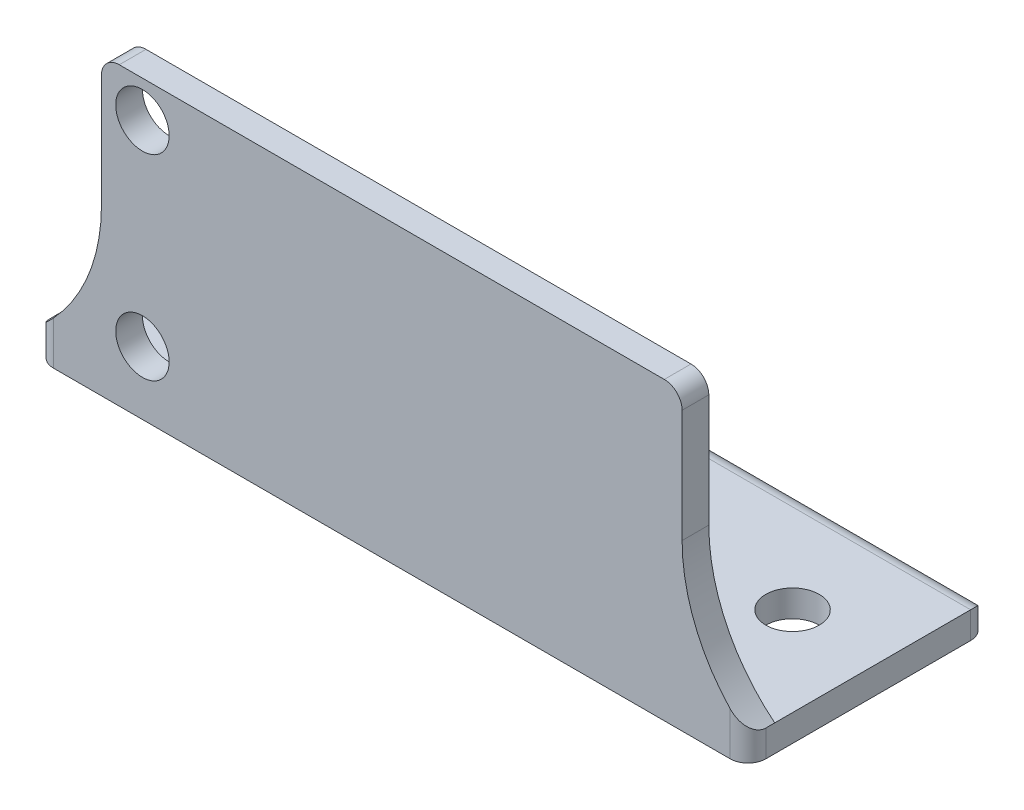
ISO-10303-21;
HEADER;
FILE_DESCRIPTION(('STEP AP214'),'2;1');
FILE_NAME('part.step','',(''),(''),'','','');
FILE_SCHEMA(('AUTOMOTIVE_DESIGN { 1 0 10303 214 1 1 1 1 }'));
ENDSEC;
DATA;
#1=APPLICATION_CONTEXT('core data for automotive mechanical design processes');
#2=APPLICATION_PROTOCOL_DEFINITION('international standard','automotive_design',2000,#1);
#3=PRODUCT_CONTEXT('',#1,'mechanical');
#4=PRODUCT('Part','Part','',(#3));
#5=PRODUCT_RELATED_PRODUCT_CATEGORY('part','',(#4));
#6=PRODUCT_DEFINITION_FORMATION('','',#4);
#7=PRODUCT_DEFINITION_CONTEXT('part definition',#1,'design');
#8=PRODUCT_DEFINITION('design','',#6,#7);
#9=PRODUCT_DEFINITION_SHAPE('','',#8);
#10=(LENGTH_UNIT() NAMED_UNIT(*) SI_UNIT(.MILLI.,.METRE.));
#11=(NAMED_UNIT(*) PLANE_ANGLE_UNIT() SI_UNIT($,.RADIAN.));
#12=(NAMED_UNIT(*) SI_UNIT($,.STERADIAN.) SOLID_ANGLE_UNIT());
#13=UNCERTAINTY_MEASURE_WITH_UNIT(LENGTH_MEASURE(1.E-05),#10,'distance_accuracy_value','');
#14=(GEOMETRIC_REPRESENTATION_CONTEXT(3) GLOBAL_UNCERTAINTY_ASSIGNED_CONTEXT((#13)) GLOBAL_UNIT_ASSIGNED_CONTEXT((#10,
#11,#12)) REPRESENTATION_CONTEXT('',''));
#15=CARTESIAN_POINT('',(0.,0.,0.));
#16=DIRECTION('',(0.,0.,1.));
#17=DIRECTION('',(1.,0.,0.));
#18=AXIS2_PLACEMENT_3D('',#15,#16,#17);
#19=CARTESIAN_POINT('',(0.,0.,1.5));
#20=DIRECTION('',(0.,0.,1.));
#21=DIRECTION('',(1.,0.,0.));
#22=AXIS2_PLACEMENT_3D('',#19,#20,#21);
#23=PLANE('',#22);
#24=CARTESIAN_POINT('',(-14.,5.5,1.5));
#25=DIRECTION('',(0.,0.,1.));
#26=DIRECTION('',(1.,0.,0.));
#27=AXIS2_PLACEMENT_3D('',#24,#25,#26);
#28=CIRCLE('',#27,1.5);
#29=CARTESIAN_POINT('',(-12.5,5.5,1.5));
#30=VERTEX_POINT('',#29);
#31=EDGE_CURVE('E379',#30,#30,#28,.T.);
#32=ORIENTED_EDGE('',*,*,#31,.F.);
#33=EDGE_LOOP('',(#32));
#34=FACE_BOUND('',#33,.T.);
#35=CARTESIAN_POINT('',(-26.3,0.215951326141568,1.5));
#36=DIRECTION('',(0.,0.,1.));
#37=DIRECTION('',(1.,0.,0.));
#38=AXIS2_PLACEMENT_3D('',#35,#36,#37);
#39=CIRCLE('',#38,10.);
#40=CARTESIAN_POINT('',(-16.3,0.215951326141575,1.5));
#41=VERTEX_POINT('',#40);
#42=CARTESIAN_POINT('',(-19.,-6.61852012379514,1.5));
#43=VERTEX_POINT('',#42);
#44=EDGE_CURVE('E204',#41,#43,#39,.F.);
#45=ORIENTED_EDGE('',*,*,#44,.T.);
#46=DIRECTION('',(0.,1.,0.));
#47=VECTOR('',#46,1.);
#48=CARTESIAN_POINT('',(-19.,-9.05,1.5));
#49=LINE('',#48,#47);
#50=CARTESIAN_POINT('',(-19.,-9.05,1.5));
#51=VERTEX_POINT('',#50);
#52=EDGE_CURVE('E397',#43,#51,#49,.F.);
#53=ORIENTED_EDGE('',*,*,#52,.T.);
#54=DIRECTION('',(-1.,0.,0.));
#55=VECTOR('',#54,1.);
#56=CARTESIAN_POINT('',(-20.,-9.05,1.5));
#57=LINE('',#56,#55);
#58=CARTESIAN_POINT('',(19.,-9.05,1.5));
#59=VERTEX_POINT('',#58);
#60=EDGE_CURVE('E361',#59,#51,#57,.T.);
#61=ORIENTED_EDGE('',*,*,#60,.F.);
#62=DIRECTION('',(0.,1.,0.));
#63=VECTOR('',#62,1.);
#64=CARTESIAN_POINT('',(19.,-7.55,1.5));
#65=LINE('',#64,#63);
#66=CARTESIAN_POINT('',(19.,-6.61852012379514,1.5));
#67=VERTEX_POINT('',#66);
#68=EDGE_CURVE('E403',#59,#67,#65,.T.);
#69=ORIENTED_EDGE('',*,*,#68,.T.);
#70=CARTESIAN_POINT('',(26.3,0.215951326141562,1.5));
#71=DIRECTION('',(0.,0.,1.));
#72=DIRECTION('',(1.,0.,0.));
#73=AXIS2_PLACEMENT_3D('',#70,#71,#72);
#74=CIRCLE('',#73,10.);
#75=CARTESIAN_POINT('',(16.3,0.215951326141562,1.5));
#76=VERTEX_POINT('',#75);
#77=EDGE_CURVE('E163',#67,#76,#74,.F.);
#78=ORIENTED_EDGE('',*,*,#77,.T.);
#79=DIRECTION('',(0.,1.,0.));
#80=VECTOR('',#79,1.);
#81=CARTESIAN_POINT('',(16.3,7.55,1.5));
#82=LINE('',#81,#80);
#83=CARTESIAN_POINT('',(16.3,6.55,1.5));
#84=VERTEX_POINT('',#83);
#85=EDGE_CURVE('E173',#76,#84,#82,.T.);
#86=ORIENTED_EDGE('',*,*,#85,.T.);
#87=CARTESIAN_POINT('',(15.3,6.55,1.5));
#88=DIRECTION('',(0.,0.,1.));
#89=DIRECTION('',(1.,0.,0.));
#90=AXIS2_PLACEMENT_3D('',#87,#88,#89);
#91=CIRCLE('',#90,1.);
#92=CARTESIAN_POINT('',(15.3,7.55,1.5));
#93=VERTEX_POINT('',#92);
#94=EDGE_CURVE('E410',#84,#93,#91,.T.);
#95=ORIENTED_EDGE('',*,*,#94,.T.);
#96=DIRECTION('',(-1.,0.,0.));
#97=VECTOR('',#96,1.);
#98=CARTESIAN_POINT('',(-16.3,7.55,1.5));
#99=LINE('',#98,#97);
#100=CARTESIAN_POINT('',(-15.3,7.55,1.5));
#101=VERTEX_POINT('',#100);
#102=EDGE_CURVE('E175',#93,#101,#99,.T.);
#103=ORIENTED_EDGE('',*,*,#102,.T.);
#104=CARTESIAN_POINT('',(-15.3,6.55,1.5));
#105=DIRECTION('',(0.,0.,1.));
#106=DIRECTION('',(1.,0.,0.));
#107=AXIS2_PLACEMENT_3D('',#104,#105,#106);
#108=CIRCLE('',#107,1.);
#109=CARTESIAN_POINT('',(-16.3,6.55,1.5));
#110=VERTEX_POINT('',#109);
#111=EDGE_CURVE('E224',#101,#110,#108,.T.);
#112=ORIENTED_EDGE('',*,*,#111,.T.);
#113=DIRECTION('',(0.,-1.,0.));
#114=VECTOR('',#113,1.);
#115=CARTESIAN_POINT('',(-16.3,7.55,1.5));
#116=LINE('',#115,#114);
#117=EDGE_CURVE('E188',#110,#41,#116,.T.);
#118=ORIENTED_EDGE('',*,*,#117,.T.);
#119=EDGE_LOOP('',(#45,#53,#61,#69,#78,#86,#95,#103,#112,#118));
#120=FACE_BOUND('',#119,.T.);
#121=CARTESIAN_POINT('',(-14.,-5.5,1.5));
#122=DIRECTION('',(0.,0.,1.));
#123=DIRECTION('',(1.,0.,0.));
#124=AXIS2_PLACEMENT_3D('',#121,#122,#123);
#125=CIRCLE('',#124,1.5);
#126=CARTESIAN_POINT('',(-12.5,-5.5,1.5));
#127=VERTEX_POINT('',#126);
#128=EDGE_CURVE('E371',#127,#127,#125,.T.);
#129=ORIENTED_EDGE('',*,*,#128,.F.);
#130=EDGE_LOOP('',(#129));
#131=FACE_BOUND('',#130,.T.);
#132=ADVANCED_FACE('F39',(#34,#120,#131),#23,.T.);
#133=CARTESIAN_POINT('',(0.,0.,0.));
#134=DIRECTION('',(0.,0.,1.));
#135=DIRECTION('',(1.,0.,0.));
#136=AXIS2_PLACEMENT_3D('',#133,#134,#135);
#137=PLANE('',#136);
#138=DIRECTION('',(-1.,0.,0.));
#139=VECTOR('',#138,1.);
#140=CARTESIAN_POINT('',(-16.3,7.55,0.));
#141=LINE('',#140,#139);
#142=CARTESIAN_POINT('',(15.3,7.55,0.));
#143=VERTEX_POINT('',#142);
#144=CARTESIAN_POINT('',(-15.3,7.55,0.));
#145=VERTEX_POINT('',#144);
#146=EDGE_CURVE('E182',#143,#145,#141,.T.);
#147=ORIENTED_EDGE('',*,*,#146,.F.);
#148=CARTESIAN_POINT('',(15.3,6.55,0.));
#149=DIRECTION('',(0.,0.,1.));
#150=DIRECTION('',(1.,0.,0.));
#151=AXIS2_PLACEMENT_3D('',#148,#149,#150);
#152=CIRCLE('',#151,1.);
#153=CARTESIAN_POINT('',(16.3,6.55,0.));
#154=VERTEX_POINT('',#153);
#155=EDGE_CURVE('E180',#143,#154,#152,.F.);
#156=ORIENTED_EDGE('',*,*,#155,.T.);
#157=DIRECTION('',(0.,1.,0.));
#158=VECTOR('',#157,1.);
#159=CARTESIAN_POINT('',(16.3,7.55,0.));
#160=LINE('',#159,#158);
#161=CARTESIAN_POINT('',(16.3,0.215951326141562,0.));
#162=VERTEX_POINT('',#161);
#163=EDGE_CURVE('E170',#162,#154,#160,.T.);
#164=ORIENTED_EDGE('',*,*,#163,.F.);
#165=CARTESIAN_POINT('',(26.3,0.215951326141562,0.));
#166=DIRECTION('',(0.,0.,1.));
#167=DIRECTION('',(1.,0.,0.));
#168=AXIS2_PLACEMENT_3D('',#165,#166,#167);
#169=CIRCLE('',#168,10.);
#170=CARTESIAN_POINT('',(20.,-7.55,0.));
#171=VERTEX_POINT('',#170);
#172=EDGE_CURVE('E152',#162,#171,#169,.T.);
#173=ORIENTED_EDGE('',*,*,#172,.T.);
#174=DIRECTION('',(1.,0.,0.));
#175=VECTOR('',#174,1.);
#176=CARTESIAN_POINT('',(-16.3,-7.55,0.));
#177=LINE('',#176,#175);
#178=CARTESIAN_POINT('',(-20.,-7.55,0.));
#179=VERTEX_POINT('',#178);
#180=EDGE_CURVE('E183',#179,#171,#177,.T.);
#181=ORIENTED_EDGE('',*,*,#180,.F.);
#182=CARTESIAN_POINT('',(-26.3,0.215951326141568,0.));
#183=DIRECTION('',(0.,0.,1.));
#184=DIRECTION('',(1.,0.,0.));
#185=AXIS2_PLACEMENT_3D('',#182,#183,#184);
#186=CIRCLE('',#185,10.);
#187=CARTESIAN_POINT('',(-16.3,0.215951326141575,0.));
#188=VERTEX_POINT('',#187);
#189=EDGE_CURVE('E200',#179,#188,#186,.T.);
#190=ORIENTED_EDGE('',*,*,#189,.T.);
#191=DIRECTION('',(0.,-1.,0.));
#192=VECTOR('',#191,1.);
#193=CARTESIAN_POINT('',(-16.3,7.55,0.));
#194=LINE('',#193,#192);
#195=CARTESIAN_POINT('',(-16.3,6.55,0.));
#196=VERTEX_POINT('',#195);
#197=EDGE_CURVE('E191',#196,#188,#194,.T.);
#198=ORIENTED_EDGE('',*,*,#197,.F.);
#199=CARTESIAN_POINT('',(-15.3,6.55,0.));
#200=DIRECTION('',(0.,0.,1.));
#201=DIRECTION('',(1.,0.,0.));
#202=AXIS2_PLACEMENT_3D('',#199,#200,#201);
#203=CIRCLE('',#202,1.);
#204=EDGE_CURVE('E310',#196,#145,#203,.F.);
#205=ORIENTED_EDGE('',*,*,#204,.T.);
#206=EDGE_LOOP('',(#147,#156,#164,#173,#181,#190,#198,#205));
#207=FACE_BOUND('',#206,.T.);
#208=CARTESIAN_POINT('',(-14.,5.5,0.));
#209=DIRECTION('',(0.,0.,1.));
#210=DIRECTION('',(1.,0.,0.));
#211=AXIS2_PLACEMENT_3D('',#208,#209,#210);
#212=CIRCLE('',#211,1.5);
#213=CARTESIAN_POINT('',(-12.5,5.5,0.));
#214=VERTEX_POINT('',#213);
#215=EDGE_CURVE('E375',#214,#214,#212,.T.);
#216=ORIENTED_EDGE('',*,*,#215,.T.);
#217=EDGE_LOOP('',(#216));
#218=FACE_BOUND('',#217,.T.);
#219=CARTESIAN_POINT('',(-14.,-5.5,0.));
#220=DIRECTION('',(0.,0.,1.));
#221=DIRECTION('',(1.,0.,0.));
#222=AXIS2_PLACEMENT_3D('',#219,#220,#221);
#223=CIRCLE('',#222,1.5);
#224=CARTESIAN_POINT('',(-12.5,-5.5,0.));
#225=VERTEX_POINT('',#224);
#226=EDGE_CURVE('E365',#225,#225,#223,.T.);
#227=ORIENTED_EDGE('',*,*,#226,.T.);
#228=EDGE_LOOP('',(#227));
#229=FACE_BOUND('',#228,.T.);
#230=ADVANCED_FACE('F178',(#207,#218,#229),#137,.F.);
#231=CARTESIAN_POINT('',(-16.3,7.55,1.5));
#232=DIRECTION('',(1.,0.,0.));
#233=DIRECTION('',(0.,1.,0.));
#234=AXIS2_PLACEMENT_3D('',#231,#232,#233);
#235=PLANE('',#234);
#236=ORIENTED_EDGE('',*,*,#117,.F.);
#237=DIRECTION('',(0.,0.,-1.));
#238=VECTOR('',#237,1.);
#239=CARTESIAN_POINT('',(-16.3,6.55,1.5));
#240=LINE('',#239,#238);
#241=EDGE_CURVE('E302',#110,#196,#240,.T.);
#242=ORIENTED_EDGE('',*,*,#241,.T.);
#243=ORIENTED_EDGE('',*,*,#197,.T.);
#244=DIRECTION('',(0.,0.,1.));
#245=VECTOR('',#244,1.);
#246=CARTESIAN_POINT('',(-16.3,0.215951326141575,1.5));
#247=LINE('',#246,#245);
#248=EDGE_CURVE('E164',#188,#41,#247,.T.);
#249=ORIENTED_EDGE('',*,*,#248,.T.);
#250=EDGE_LOOP('',(#236,#242,#243,#249));
#251=FACE_BOUND('',#250,.T.);
#252=ADVANCED_FACE('F238',(#251),#235,.F.);
#253=CARTESIAN_POINT('',(16.3,7.55,1.5));
#254=DIRECTION('',(-1.,0.,0.));
#255=DIRECTION('',(0.,0.,1.));
#256=AXIS2_PLACEMENT_3D('',#253,#254,#255);
#257=PLANE('',#256);
#258=ORIENTED_EDGE('',*,*,#163,.T.);
#259=DIRECTION('',(0.,0.,-1.));
#260=VECTOR('',#259,1.);
#261=CARTESIAN_POINT('',(16.3,6.55,1.5));
#262=LINE('',#261,#260);
#263=EDGE_CURVE('E313',#154,#84,#262,.F.);
#264=ORIENTED_EDGE('',*,*,#263,.T.);
#265=ORIENTED_EDGE('',*,*,#85,.F.);
#266=DIRECTION('',(0.,0.,-1.));
#267=VECTOR('',#266,1.);
#268=CARTESIAN_POINT('',(16.3,0.215951326141562,1.5));
#269=LINE('',#268,#267);
#270=EDGE_CURVE('E156',#76,#162,#269,.T.);
#271=ORIENTED_EDGE('',*,*,#270,.T.);
#272=EDGE_LOOP('',(#258,#264,#265,#271));
#273=FACE_BOUND('',#272,.T.);
#274=ADVANCED_FACE('F169',(#273),#257,.F.);
#275=CARTESIAN_POINT('',(-16.3,7.55,1.5));
#276=DIRECTION('',(0.,-1.,0.));
#277=DIRECTION('',(0.,0.,-1.));
#278=AXIS2_PLACEMENT_3D('',#275,#276,#277);
#279=PLANE('',#278);
#280=ORIENTED_EDGE('',*,*,#102,.F.);
#281=DIRECTION('',(0.,0.,-1.));
#282=VECTOR('',#281,1.);
#283=CARTESIAN_POINT('',(15.3,7.55,1.5));
#284=LINE('',#283,#282);
#285=EDGE_CURVE('E439',#93,#143,#284,.T.);
#286=ORIENTED_EDGE('',*,*,#285,.T.);
#287=ORIENTED_EDGE('',*,*,#146,.T.);
#288=DIRECTION('',(0.,0.,-1.));
#289=VECTOR('',#288,1.);
#290=CARTESIAN_POINT('',(-15.3,7.55,1.5));
#291=LINE('',#290,#289);
#292=EDGE_CURVE('E436',#145,#101,#291,.F.);
#293=ORIENTED_EDGE('',*,*,#292,.T.);
#294=EDGE_LOOP('',(#280,#286,#287,#293));
#295=FACE_BOUND('',#294,.T.);
#296=ADVANCED_FACE('F289',(#295),#279,.F.);
#297=CARTESIAN_POINT('',(-14.,5.5,1.5));
#298=DIRECTION('',(0.,0.,-1.));
#299=DIRECTION('',(-1.,0.,0.));
#300=AXIS2_PLACEMENT_3D('',#297,#298,#299);
#301=CYLINDRICAL_SURFACE('',#300,1.5);
#302=ORIENTED_EDGE('',*,*,#31,.T.);
#303=EDGE_LOOP('',(#302));
#304=FACE_BOUND('',#303,.T.);
#305=ORIENTED_EDGE('',*,*,#215,.F.);
#306=EDGE_LOOP('',(#305));
#307=FACE_BOUND('',#306,.T.);
#308=ADVANCED_FACE('F286',(#304,#307),#301,.F.);
#309=CARTESIAN_POINT('',(-14.,-5.5,1.5));
#310=DIRECTION('',(0.,0.,-1.));
#311=DIRECTION('',(-1.,0.,0.));
#312=AXIS2_PLACEMENT_3D('',#309,#310,#311);
#313=CYLINDRICAL_SURFACE('',#312,1.5);
#314=ORIENTED_EDGE('',*,*,#128,.T.);
#315=EDGE_LOOP('',(#314));
#316=FACE_BOUND('',#315,.T.);
#317=ORIENTED_EDGE('',*,*,#226,.F.);
#318=EDGE_LOOP('',(#317));
#319=FACE_BOUND('',#318,.T.);
#320=ADVANCED_FACE('F475',(#316,#319),#313,.F.);
#321=CARTESIAN_POINT('',(0.,-9.05,0.));
#322=DIRECTION('',(0.,-1.,0.));
#323=DIRECTION('',(0.,0.,-1.));
#324=AXIS2_PLACEMENT_3D('',#321,#322,#323);
#325=PLANE('',#324);
#326=CARTESIAN_POINT('',(-15.,-9.05,-6.));
#327=DIRECTION('',(0.,-1.,0.));
#328=DIRECTION('',(0.,0.,-1.));
#329=AXIS2_PLACEMENT_3D('',#326,#327,#328);
#330=CIRCLE('',#329,1.5);
#331=CARTESIAN_POINT('',(-15.,-9.05,-7.5));
#332=VERTEX_POINT('',#331);
#333=EDGE_CURVE('E340',#332,#332,#330,.T.);
#334=ORIENTED_EDGE('',*,*,#333,.F.);
#335=EDGE_LOOP('',(#334));
#336=FACE_BOUND('',#335,.T.);
#337=ORIENTED_EDGE('',*,*,#60,.T.);
#338=CARTESIAN_POINT('',(-19.,-9.05,0.5));
#339=DIRECTION('',(0.,-1.,0.));
#340=DIRECTION('',(0.,0.,-1.));
#341=AXIS2_PLACEMENT_3D('',#338,#339,#340);
#342=CIRCLE('',#341,1.);
#343=CARTESIAN_POINT('',(-20.,-9.05,0.5));
#344=VERTEX_POINT('',#343);
#345=EDGE_CURVE('E250',#51,#344,#342,.T.);
#346=ORIENTED_EDGE('',*,*,#345,.T.);
#347=DIRECTION('',(0.,0.,-1.));
#348=VECTOR('',#347,1.);
#349=CARTESIAN_POINT('',(-20.,-9.05,1.5));
#350=LINE('',#349,#348);
#351=CARTESIAN_POINT('',(-20.,-9.05,-11.));
#352=VERTEX_POINT('',#351);
#353=EDGE_CURVE('E348',#344,#352,#350,.T.);
#354=ORIENTED_EDGE('',*,*,#353,.T.);
#355=CARTESIAN_POINT('',(-19.,-9.05,-11.));
#356=DIRECTION('',(0.,-1.,0.));
#357=DIRECTION('',(0.,0.,-1.));
#358=AXIS2_PLACEMENT_3D('',#355,#356,#357);
#359=CIRCLE('',#358,1.);
#360=CARTESIAN_POINT('',(-19.,-9.05,-12.));
#361=VERTEX_POINT('',#360);
#362=EDGE_CURVE('E407',#352,#361,#359,.T.);
#363=ORIENTED_EDGE('',*,*,#362,.T.);
#364=DIRECTION('',(1.,0.,0.));
#365=VECTOR('',#364,1.);
#366=CARTESIAN_POINT('',(-20.,-9.05,-12.));
#367=LINE('',#366,#365);
#368=CARTESIAN_POINT('',(19.,-9.05,-12.));
#369=VERTEX_POINT('',#368);
#370=EDGE_CURVE('E352',#361,#369,#367,.T.);
#371=ORIENTED_EDGE('',*,*,#370,.T.);
#372=CARTESIAN_POINT('',(19.,-9.05,-11.));
#373=DIRECTION('',(0.,-1.,0.));
#374=DIRECTION('',(0.,0.,-1.));
#375=AXIS2_PLACEMENT_3D('',#372,#373,#374);
#376=CIRCLE('',#375,1.);
#377=CARTESIAN_POINT('',(20.,-9.05,-11.));
#378=VERTEX_POINT('',#377);
#379=EDGE_CURVE('E402',#369,#378,#376,.T.);
#380=ORIENTED_EDGE('',*,*,#379,.T.);
#381=DIRECTION('',(0.,0.,1.));
#382=VECTOR('',#381,1.);
#383=CARTESIAN_POINT('',(20.,-9.05,1.5));
#384=LINE('',#383,#382);
#385=CARTESIAN_POINT('',(20.,-9.05,0.5));
#386=VERTEX_POINT('',#385);
#387=EDGE_CURVE('E357',#378,#386,#384,.T.);
#388=ORIENTED_EDGE('',*,*,#387,.T.);
#389=CARTESIAN_POINT('',(19.,-9.05,0.5));
#390=DIRECTION('',(0.,-1.,0.));
#391=DIRECTION('',(0.,0.,-1.));
#392=AXIS2_PLACEMENT_3D('',#389,#390,#391);
#393=CIRCLE('',#392,1.);
#394=EDGE_CURVE('E414',#386,#59,#393,.T.);
#395=ORIENTED_EDGE('',*,*,#394,.T.);
#396=EDGE_LOOP('',(#337,#346,#354,#363,#371,#380,#388,#395));
#397=FACE_BOUND('',#396,.T.);
#398=CARTESIAN_POINT('',(15.,-9.05,-6.));
#399=DIRECTION('',(0.,-1.,0.));
#400=DIRECTION('',(0.,0.,-1.));
#401=AXIS2_PLACEMENT_3D('',#398,#399,#400);
#402=CIRCLE('',#401,1.5);
#403=CARTESIAN_POINT('',(15.,-9.05,-7.5));
#404=VERTEX_POINT('',#403);
#405=EDGE_CURVE('E331',#404,#404,#402,.T.);
#406=ORIENTED_EDGE('',*,*,#405,.F.);
#407=EDGE_LOOP('',(#406));
#408=FACE_BOUND('',#407,.T.);
#409=ADVANCED_FACE('F420',(#336,#397,#408),#325,.T.);
#410=CARTESIAN_POINT('',(0.,-7.55,0.));
#411=DIRECTION('',(0.,-1.,0.));
#412=DIRECTION('',(0.,0.,-1.));
#413=AXIS2_PLACEMENT_3D('',#410,#411,#412);
#414=PLANE('',#413);
#415=DIRECTION('',(0.,0.,1.));
#416=VECTOR('',#415,1.);
#417=CARTESIAN_POINT('',(20.,-7.55,1.5));
#418=LINE('',#417,#416);
#419=CARTESIAN_POINT('',(20.,-7.55,-11.));
#420=VERTEX_POINT('',#419);
#421=EDGE_CURVE('E353',#420,#171,#418,.T.);
#422=ORIENTED_EDGE('',*,*,#421,.F.);
#423=DIRECTION('',(1.,0.,0.));
#424=VECTOR('',#423,1.);
#425=CARTESIAN_POINT('',(0.,-7.55,-11.));
#426=LINE('',#425,#424);
#427=CARTESIAN_POINT('',(-20.,-7.55,-11.));
#428=VERTEX_POINT('',#427);
#429=EDGE_CURVE('E11',#420,#428,#426,.F.);
#430=ORIENTED_EDGE('',*,*,#429,.T.);
#431=DIRECTION('',(0.,0.,-1.));
#432=VECTOR('',#431,1.);
#433=CARTESIAN_POINT('',(-20.,-7.55,1.5));
#434=LINE('',#433,#432);
#435=EDGE_CURVE('E344',#179,#428,#434,.T.);
#436=ORIENTED_EDGE('',*,*,#435,.F.);
#437=ORIENTED_EDGE('',*,*,#180,.T.);
#438=EDGE_LOOP('',(#422,#430,#436,#437));
#439=FACE_BOUND('',#438,.T.);
#440=CARTESIAN_POINT('',(-15.,-7.55,-6.));
#441=DIRECTION('',(0.,-1.,0.));
#442=DIRECTION('',(0.,0.,-1.));
#443=AXIS2_PLACEMENT_3D('',#440,#441,#442);
#444=CIRCLE('',#443,1.5);
#445=CARTESIAN_POINT('',(-15.,-7.55,-7.5));
#446=VERTEX_POINT('',#445);
#447=EDGE_CURVE('E337',#446,#446,#444,.T.);
#448=ORIENTED_EDGE('',*,*,#447,.T.);
#449=EDGE_LOOP('',(#448));
#450=FACE_BOUND('',#449,.T.);
#451=CARTESIAN_POINT('',(15.,-7.55,-6.));
#452=DIRECTION('',(0.,-1.,0.));
#453=DIRECTION('',(0.,0.,-1.));
#454=AXIS2_PLACEMENT_3D('',#451,#452,#453);
#455=CIRCLE('',#454,1.5);
#456=CARTESIAN_POINT('',(15.,-7.55,-7.5));
#457=VERTEX_POINT('',#456);
#458=EDGE_CURVE('E328',#457,#457,#455,.T.);
#459=ORIENTED_EDGE('',*,*,#458,.T.);
#460=EDGE_LOOP('',(#459));
#461=FACE_BOUND('',#460,.T.);
#462=ADVANCED_FACE('F456',(#439,#450,#461),#414,.F.);
#463=CARTESIAN_POINT('',(-20.,-9.05,1.5));
#464=DIRECTION('',(1.,0.,0.));
#465=DIRECTION('',(0.,0.,-1.));
#466=AXIS2_PLACEMENT_3D('',#463,#464,#465);
#467=PLANE('',#466);
#468=ORIENTED_EDGE('',*,*,#353,.F.);
#469=DIRECTION('',(0.,1.,0.));
#470=VECTOR('',#469,1.);
#471=CARTESIAN_POINT('',(-20.,-7.55,0.5));
#472=LINE('',#471,#470);
#473=CARTESIAN_POINT('',(-20.,-7.55,0.5));
#474=VERTEX_POINT('',#473);
#475=EDGE_CURVE('E211',#344,#474,#472,.T.);
#476=ORIENTED_EDGE('',*,*,#475,.T.);
#477=EDGE_CURVE('E366',#474,#179,#434,.T.);
#478=ORIENTED_EDGE('',*,*,#477,.T.);
#479=ORIENTED_EDGE('',*,*,#435,.T.);
#480=DIRECTION('',(0.,1.,0.));
#481=VECTOR('',#480,1.);
#482=CARTESIAN_POINT('',(-20.,-9.05,-11.));
#483=LINE('',#482,#481);
#484=EDGE_CURVE('E208',#428,#352,#483,.F.);
#485=ORIENTED_EDGE('',*,*,#484,.T.);
#486=EDGE_LOOP('',(#468,#476,#478,#479,#485));
#487=FACE_BOUND('',#486,.T.);
#488=ADVANCED_FACE('F424',(#487),#467,.F.);
#489=CARTESIAN_POINT('',(-20.,-9.05,-12.));
#490=DIRECTION('',(0.,0.,1.));
#491=DIRECTION('',(1.,0.,0.));
#492=AXIS2_PLACEMENT_3D('',#489,#490,#491);
#493=PLANE('',#492);
#494=ORIENTED_EDGE('',*,*,#370,.F.);
#495=DIRECTION('',(0.,1.,0.));
#496=VECTOR('',#495,1.);
#497=CARTESIAN_POINT('',(-19.,-9.05,-12.));
#498=LINE('',#497,#496);
#499=CARTESIAN_POINT('',(-19.,-8.55,-12.));
#500=VERTEX_POINT('',#499);
#501=EDGE_CURVE('E49',#361,#500,#498,.T.);
#502=ORIENTED_EDGE('',*,*,#501,.T.);
#503=DIRECTION('',(1.,0.,0.));
#504=VECTOR('',#503,1.);
#505=CARTESIAN_POINT('',(-20.,-8.55,-12.));
#506=LINE('',#505,#504);
#507=CARTESIAN_POINT('',(19.,-8.55,-12.));
#508=VERTEX_POINT('',#507);
#509=EDGE_CURVE('E317',#500,#508,#506,.T.);
#510=ORIENTED_EDGE('',*,*,#509,.T.);
#511=DIRECTION('',(0.,1.,0.));
#512=VECTOR('',#511,1.);
#513=CARTESIAN_POINT('',(19.,-9.05,-12.));
#514=LINE('',#513,#512);
#515=EDGE_CURVE('E312',#508,#369,#514,.F.);
#516=ORIENTED_EDGE('',*,*,#515,.T.);
#517=EDGE_LOOP('',(#494,#502,#510,#516));
#518=FACE_BOUND('',#517,.T.);
#519=ADVANCED_FACE('F427',(#518),#493,.F.);
#520=CARTESIAN_POINT('',(20.,-9.05,1.5));
#521=DIRECTION('',(-1.,0.,0.));
#522=DIRECTION('',(0.,0.,1.));
#523=AXIS2_PLACEMENT_3D('',#520,#521,#522);
#524=PLANE('',#523);
#525=CARTESIAN_POINT('',(20.,-7.55,0.5));
#526=VERTEX_POINT('',#525);
#527=EDGE_CURVE('E158',#171,#526,#418,.T.);
#528=ORIENTED_EDGE('',*,*,#527,.T.);
#529=DIRECTION('',(0.,1.,0.));
#530=VECTOR('',#529,1.);
#531=CARTESIAN_POINT('',(20.,-9.05,0.5));
#532=LINE('',#531,#530);
#533=EDGE_CURVE('E434',#526,#386,#532,.F.);
#534=ORIENTED_EDGE('',*,*,#533,.T.);
#535=ORIENTED_EDGE('',*,*,#387,.F.);
#536=DIRECTION('',(0.,1.,0.));
#537=VECTOR('',#536,1.);
#538=CARTESIAN_POINT('',(20.,-9.05,-11.));
#539=LINE('',#538,#537);
#540=EDGE_CURVE('E249',#378,#420,#539,.T.);
#541=ORIENTED_EDGE('',*,*,#540,.T.);
#542=ORIENTED_EDGE('',*,*,#421,.T.);
#543=EDGE_LOOP('',(#528,#534,#535,#541,#542));
#544=FACE_BOUND('',#543,.T.);
#545=ADVANCED_FACE('F431',(#544),#524,.F.);
#546=CARTESIAN_POINT('',(-15.,-9.05,-6.));
#547=DIRECTION('',(0.,1.,0.));
#548=DIRECTION('',(0.,0.,1.));
#549=AXIS2_PLACEMENT_3D('',#546,#547,#548);
#550=CYLINDRICAL_SURFACE('',#549,1.5);
#551=ORIENTED_EDGE('',*,*,#333,.T.);
#552=EDGE_LOOP('',(#551));
#553=FACE_BOUND('',#552,.T.);
#554=ORIENTED_EDGE('',*,*,#447,.F.);
#555=EDGE_LOOP('',(#554));
#556=FACE_BOUND('',#555,.T.);
#557=ADVANCED_FACE('F462',(#553,#556),#550,.F.);
#558=CARTESIAN_POINT('',(15.,-9.05,-6.));
#559=DIRECTION('',(0.,1.,0.));
#560=DIRECTION('',(0.,0.,1.));
#561=AXIS2_PLACEMENT_3D('',#558,#559,#560);
#562=CYLINDRICAL_SURFACE('',#561,1.5);
#563=ORIENTED_EDGE('',*,*,#405,.T.);
#564=EDGE_LOOP('',(#563));
#565=FACE_BOUND('',#564,.T.);
#566=ORIENTED_EDGE('',*,*,#458,.F.);
#567=EDGE_LOOP('',(#566));
#568=FACE_BOUND('',#567,.T.);
#569=ADVANCED_FACE('F237',(#565,#568),#562,.F.);
#570=CARTESIAN_POINT('',(26.3,0.215951326141562,0.));
#571=DIRECTION('',(0.,0.,-1.));
#572=DIRECTION('',(-1.,0.,0.));
#573=AXIS2_PLACEMENT_3D('',#570,#571,#572);
#574=CYLINDRICAL_SURFACE('',#573,10.);
#575=ORIENTED_EDGE('',*,*,#77,.F.);
#576=CARTESIAN_POINT('',(19.,-6.61852012379514,1.5));
#577=CARTESIAN_POINT('',(19.0360452112758,-6.65702640447863,1.49999140489921));
#578=CARTESIAN_POINT('',(19.072415896129,-6.69525815178405,1.4980497188281));
#579=CARTESIAN_POINT('',(19.1456146392547,-6.77100289617753,1.4900304402909));
#580=CARTESIAN_POINT('',(19.1824435451223,-6.80851407453591,1.48394351484482));
#581=CARTESIAN_POINT('',(19.2565911707597,-6.8828641455855,1.46727370575777));
#582=CARTESIAN_POINT('',(19.2939109408753,-6.91969167922998,1.45664379515559));
#583=CARTESIAN_POINT('',(19.3682089509647,-6.9918884426141,1.43057565408168));
#584=CARTESIAN_POINT('',(19.4051875015814,-7.02725912729334,1.41514235935897));
#585=CARTESIAN_POINT('',(19.4897067057035,-7.10690536896449,1.37352327266979));
#586=CARTESIAN_POINT('',(19.5369659606525,-7.15054019449224,1.34548715406757));
#587=CARTESIAN_POINT('',(19.628382180488,-7.23343139480419,1.27992473078335));
#588=CARTESIAN_POINT('',(19.6725503458269,-7.27270391657639,1.24243522700223));
#589=CARTESIAN_POINT('',(19.7477347205683,-7.33850560623171,1.16572749853639));
#590=CARTESIAN_POINT('',(19.7796425364105,-7.36603044694754,1.12824558195783));
#591=CARTESIAN_POINT('',(19.838712996422,-7.41643205118549,1.04688223077961));
#592=CARTESIAN_POINT('',(19.8658779189502,-7.43931104731292,1.00300388754333));
#593=CARTESIAN_POINT('',(19.9100748721302,-7.47622370783625,0.916810362018491));
#594=CARTESIAN_POINT('',(19.9280267914617,-7.49108071122656,0.875320933918156));
#595=CARTESIAN_POINT('',(19.9583991397003,-7.51609155663621,0.789056389953942));
#596=CARTESIAN_POINT('',(19.9708285548871,-7.52625304034337,0.744286751025162));
#597=CARTESIAN_POINT('',(19.9866558815615,-7.53916054109255,0.666131461003642));
#598=CARTESIAN_POINT('',(19.9916349086254,-7.54320855656391,0.633270383330742));
#599=CARTESIAN_POINT('',(19.9983179350782,-7.54863546110347,0.566948768249265));
#600=CARTESIAN_POINT('',(20.0000167598159,-7.55001013288887,0.533487367585005));
#601=CARTESIAN_POINT('',(20.,-7.55,0.500000000000001));
#602=B_SPLINE_CURVE_WITH_KNOTS('',3,(#576,#577,#578,#579,#580,#581,#582,#583,#584,#585,#586,
#587,#588,#589,#590,#591,#592,#593,#594,#595,#596,#597,#598,#599,#600,#601),.UNSPECIFIED.,.F.,
.F.,(4,2,2,2,2,2,2,2,2,2,2,2,4),(0.,0.158229408385329,0.316816252251324,0.477086067976596,
0.637191738104466,0.846956202728415,1.05591635671487,1.22446706014607,1.39293657222013,
1.53510007074011,1.67703138437126,1.77721820348046,1.87756294261449),.UNSPECIFIED.);
#603=EDGE_CURVE('E241',#67,#526,#602,.T.);
#604=ORIENTED_EDGE('',*,*,#603,.T.);
#605=ORIENTED_EDGE('',*,*,#527,.F.);
#606=ORIENTED_EDGE('',*,*,#172,.F.);
#607=ORIENTED_EDGE('',*,*,#270,.F.);
#608=EDGE_LOOP('',(#575,#604,#605,#606,#607));
#609=FACE_BOUND('',#608,.T.);
#610=ADVANCED_FACE('F155',(#609),#574,.F.);
#611=CARTESIAN_POINT('',(-26.3,0.215951326141568,0.));
#612=DIRECTION('',(0.,0.,1.));
#613=DIRECTION('',(1.,0.,0.));
#614=AXIS2_PLACEMENT_3D('',#611,#612,#613);
#615=CYLINDRICAL_SURFACE('',#614,10.);
#616=ORIENTED_EDGE('',*,*,#477,.F.);
#617=CARTESIAN_POINT('',(-20.,-7.55,0.5));
#618=CARTESIAN_POINT('',(-20.0000022629944,-7.55000111070974,0.523483177146361));
#619=CARTESIAN_POINT('',(-19.9991720948432,-7.5493284424302,0.546953308407603));
#620=CARTESIAN_POINT('',(-19.9958765467717,-7.54665354087749,0.593691343456856));
#621=CARTESIAN_POINT('',(-19.9934119376251,-7.5446519343077,0.616959337331925));
#622=CARTESIAN_POINT('',(-19.9836536808852,-7.53671548720342,0.685918562577398));
#623=CARTESIAN_POINT('',(-19.9739947019632,-7.52884843992892,0.731085466713407));
#624=CARTESIAN_POINT('',(-19.9489971665541,-7.50836216127996,0.818552833673136));
#625=CARTESIAN_POINT('',(-19.9336669828419,-7.4957499350622,0.860857413964739));
#626=CARTESIAN_POINT('',(-19.8981761254136,-7.46631277524434,0.94185724973513));
#627=CARTESIAN_POINT('',(-19.8780092373101,-7.44948242076556,0.980547772137039));
#628=CARTESIAN_POINT('',(-19.832362227106,-7.41101432001569,1.05609936307936));
#629=CARTESIAN_POINT('',(-19.8066221962172,-7.38913544122392,1.09267867663757));
#630=CARTESIAN_POINT('',(-19.7518426182307,-7.34202096476042,1.16079147546238));
#631=CARTESIAN_POINT('',(-19.7228031118356,-7.3167854084961,1.19232502296213));
#632=CARTESIAN_POINT('',(-19.6465189452743,-7.24963135039891,1.26556252602853));
#633=CARTESIAN_POINT('',(-19.5976943950691,-7.20588893438323,1.30396353080186));
#634=CARTESIAN_POINT('',(-19.4969566383345,-7.113667651918,1.36987615628284));
#635=CARTESIAN_POINT('',(-19.4450297559323,-7.06516709912194,1.39733472956045));
#636=CARTESIAN_POINT('',(-19.3269862522167,-6.95239974575749,1.44771024761559));
#637=CARTESIAN_POINT('',(-19.2605472016265,-6.88720798380556,1.46780748269256));
#638=CARTESIAN_POINT('',(-19.1617624523165,-6.7874585663106,1.48739332073283));
#639=CARTESIAN_POINT('',(-19.1291457474378,-6.75405890150197,1.49216400909342));
#640=CARTESIAN_POINT('',(-19.0642759933097,-6.68669150444882,1.49846102987188));
#641=CARTESIAN_POINT('',(-19.0320225106784,-6.6527246044874,1.49999175566321));
#642=CARTESIAN_POINT('',(-19.,-6.61852012379514,1.5));
#643=B_SPLINE_CURVE_WITH_KNOTS('',3,(#617,#618,#619,#620,#621,#622,#623,#624,#625,#626,#627,
#628,#629,#630,#631,#632,#633,#634,#635,#636,#637,#638,#639,#640,#641,#642),.UNSPECIFIED.,.F.,
.F.,(4,2,2,2,2,2,2,2,2,2,2,2,4),(0.,0.0704000884927361,0.140767001128799,0.28055342701782,
0.420134295254276,0.559895472383457,0.708728344383364,0.857559380576384,1.08420774112564,
1.3119418722275,1.59621139927509,1.7369031374319,1.87740397573385),.UNSPECIFIED.);
#644=EDGE_CURVE('E215',#474,#43,#643,.T.);
#645=ORIENTED_EDGE('',*,*,#644,.T.);
#646=ORIENTED_EDGE('',*,*,#44,.F.);
#647=ORIENTED_EDGE('',*,*,#248,.F.);
#648=ORIENTED_EDGE('',*,*,#189,.F.);
#649=EDGE_LOOP('',(#616,#645,#646,#647,#648));
#650=FACE_BOUND('',#649,.T.);
#651=ADVANCED_FACE('F229',(#650),#615,.F.);
#652=CARTESIAN_POINT('',(-19.,-9.05,0.5));
#653=DIRECTION('',(0.,-1.,0.));
#654=DIRECTION('',(0.,0.,-1.));
#655=AXIS2_PLACEMENT_3D('',#652,#653,#654);
#656=CYLINDRICAL_SURFACE('',#655,1.);
#657=ORIENTED_EDGE('',*,*,#345,.F.);
#658=ORIENTED_EDGE('',*,*,#52,.F.);
#659=ORIENTED_EDGE('',*,*,#644,.F.);
#660=ORIENTED_EDGE('',*,*,#475,.F.);
#661=EDGE_LOOP('',(#657,#658,#659,#660));
#662=FACE_BOUND('',#661,.T.);
#663=ADVANCED_FACE('F226',(#662),#656,.T.);
#664=CARTESIAN_POINT('',(19.,0.,0.5));
#665=DIRECTION('',(0.,-1.,0.));
#666=DIRECTION('',(0.,0.,-1.));
#667=AXIS2_PLACEMENT_3D('',#664,#665,#666);
#668=CYLINDRICAL_SURFACE('',#667,1.);
#669=ORIENTED_EDGE('',*,*,#394,.F.);
#670=ORIENTED_EDGE('',*,*,#533,.F.);
#671=ORIENTED_EDGE('',*,*,#603,.F.);
#672=ORIENTED_EDGE('',*,*,#68,.F.);
#673=EDGE_LOOP('',(#669,#670,#671,#672));
#674=FACE_BOUND('',#673,.T.);
#675=ADVANCED_FACE('F253',(#674),#668,.T.);
#676=CARTESIAN_POINT('',(15.3,6.55,1.5));
#677=DIRECTION('',(0.,0.,-1.));
#678=DIRECTION('',(-1.,0.,0.));
#679=AXIS2_PLACEMENT_3D('',#676,#677,#678);
#680=CYLINDRICAL_SURFACE('',#679,1.);
#681=ORIENTED_EDGE('',*,*,#94,.F.);
#682=ORIENTED_EDGE('',*,*,#263,.F.);
#683=ORIENTED_EDGE('',*,*,#155,.F.);
#684=ORIENTED_EDGE('',*,*,#285,.F.);
#685=EDGE_LOOP('',(#681,#682,#683,#684));
#686=FACE_BOUND('',#685,.T.);
#687=ADVANCED_FACE('F257',(#686),#680,.T.);
#688=CARTESIAN_POINT('',(-15.3,6.55,1.5));
#689=DIRECTION('',(0.,0.,-1.));
#690=DIRECTION('',(-1.,0.,0.));
#691=AXIS2_PLACEMENT_3D('',#688,#689,#690);
#692=CYLINDRICAL_SURFACE('',#691,1.);
#693=ORIENTED_EDGE('',*,*,#111,.F.);
#694=ORIENTED_EDGE('',*,*,#292,.F.);
#695=ORIENTED_EDGE('',*,*,#204,.F.);
#696=ORIENTED_EDGE('',*,*,#241,.F.);
#697=EDGE_LOOP('',(#693,#694,#695,#696));
#698=FACE_BOUND('',#697,.T.);
#699=ADVANCED_FACE('F261',(#698),#692,.T.);
#700=CARTESIAN_POINT('',(-19.,-9.05,-11.));
#701=DIRECTION('',(0.,1.,0.));
#702=DIRECTION('',(0.,0.,1.));
#703=AXIS2_PLACEMENT_3D('',#700,#701,#702);
#704=CYLINDRICAL_SURFACE('',#703,1.);
#705=ORIENTED_EDGE('',*,*,#362,.F.);
#706=ORIENTED_EDGE('',*,*,#484,.F.);
#707=CARTESIAN_POINT('',(-19.,-8.55,-11.));
#708=DIRECTION('',(0.707106781186547,0.707106781186547,0.));
#709=DIRECTION('',(-0.707106781186547,0.707106781186547,0.));
#710=AXIS2_PLACEMENT_3D('',#707,#708,#709);
#711=ELLIPSE('',#710,1.41421356237309,1.);
#712=EDGE_CURVE('E43',#500,#428,#711,.T.);
#713=ORIENTED_EDGE('',*,*,#712,.F.);
#714=ORIENTED_EDGE('',*,*,#501,.F.);
#715=EDGE_LOOP('',(#705,#706,#713,#714));
#716=FACE_BOUND('',#715,.T.);
#717=ADVANCED_FACE('F41',(#716),#704,.T.);
#718=CARTESIAN_POINT('',(19.,-9.05,-11.));
#719=DIRECTION('',(0.,1.,0.));
#720=DIRECTION('',(0.,0.,1.));
#721=AXIS2_PLACEMENT_3D('',#718,#719,#720);
#722=CYLINDRICAL_SURFACE('',#721,1.);
#723=ORIENTED_EDGE('',*,*,#379,.F.);
#724=ORIENTED_EDGE('',*,*,#515,.F.);
#725=CARTESIAN_POINT('',(19.,-8.55,-11.));
#726=DIRECTION('',(-0.707106781186547,0.707106781186547,0.));
#727=DIRECTION('',(0.707106781186547,0.707106781186547,0.));
#728=AXIS2_PLACEMENT_3D('',#725,#726,#727);
#729=ELLIPSE('',#728,1.41421356237309,1.);
#730=EDGE_CURVE('E64',#420,#508,#729,.T.);
#731=ORIENTED_EDGE('',*,*,#730,.F.);
#732=ORIENTED_EDGE('',*,*,#540,.F.);
#733=EDGE_LOOP('',(#723,#724,#731,#732));
#734=FACE_BOUND('',#733,.T.);
#735=ADVANCED_FACE('F268',(#734),#722,.T.);
#736=CARTESIAN_POINT('',(-20.,-8.55,-11.));
#737=DIRECTION('',(1.,0.,0.));
#738=DIRECTION('',(0.,0.,-1.));
#739=AXIS2_PLACEMENT_3D('',#736,#737,#738);
#740=CYLINDRICAL_SURFACE('',#739,1.);
#741=ORIENTED_EDGE('',*,*,#712,.T.);
#742=ORIENTED_EDGE('',*,*,#429,.F.);
#743=ORIENTED_EDGE('',*,*,#730,.T.);
#744=ORIENTED_EDGE('',*,*,#509,.F.);
#745=EDGE_LOOP('',(#741,#742,#743,#744));
#746=FACE_BOUND('',#745,.T.);
#747=ADVANCED_FACE('F266',(#746),#740,.T.);
#748=CLOSED_SHELL('',(#132,#230,#252,#274,#296,#308,#320,#409,#462,#488,#519,#545,#557,#569,
#610,#651,#663,#675,#687,#699,#717,#735,#747));
#749=MANIFOLD_SOLID_BREP('B2',#748);
#750=ADVANCED_BREP_SHAPE_REPRESENTATION('',(#18,#749),#14);
#751=SHAPE_DEFINITION_REPRESENTATION(#9,#750);
ENDSEC;
END-ISO-10303-21;
